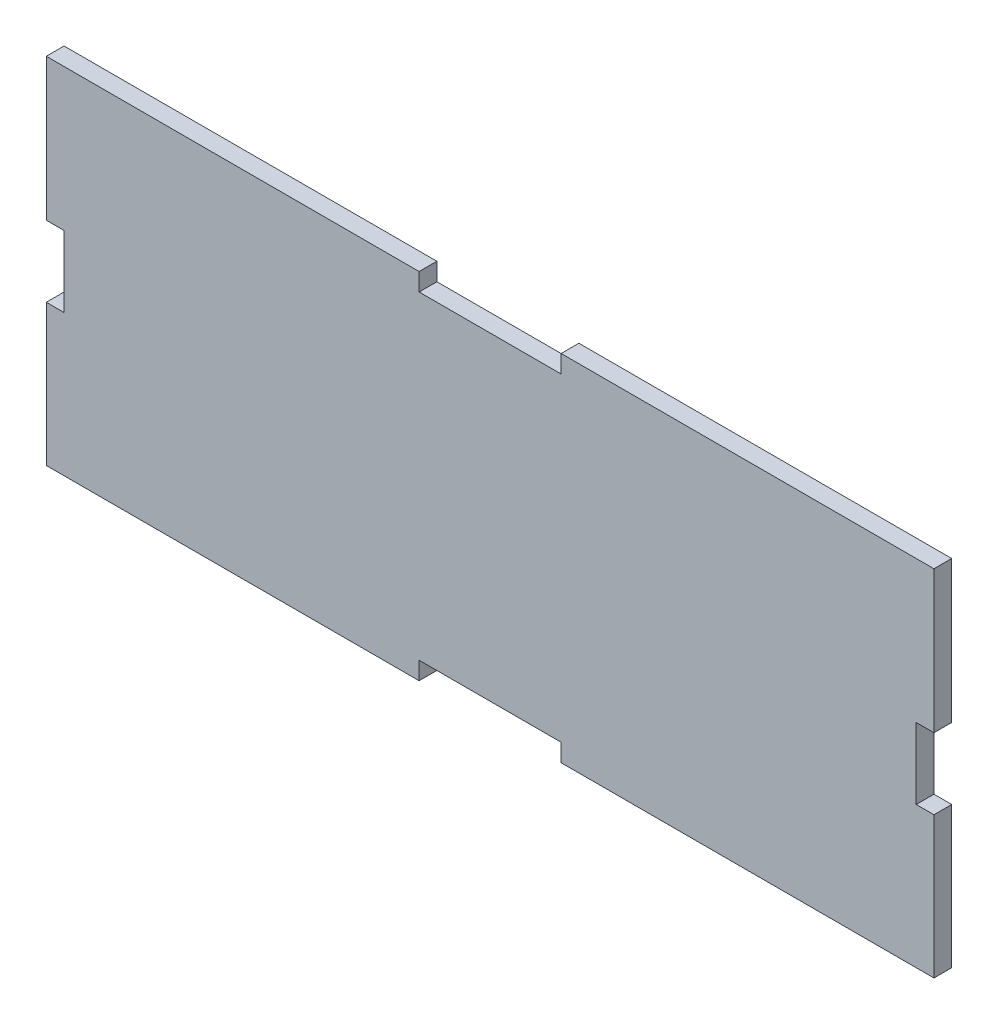
ISO-10303-21;
HEADER;
FILE_DESCRIPTION(('STEP AP214'),'2;1');
FILE_NAME('part.step','',(''),(''),'','','');
FILE_SCHEMA(('AUTOMOTIVE_DESIGN { 1 0 10303 214 1 1 1 1 }'));
ENDSEC;
DATA;
#1=APPLICATION_CONTEXT('core data for automotive mechanical design processes');
#2=APPLICATION_PROTOCOL_DEFINITION('international standard','automotive_design',2000,#1);
#3=PRODUCT_CONTEXT('',#1,'mechanical');
#4=PRODUCT('Part','Part','',(#3));
#5=PRODUCT_RELATED_PRODUCT_CATEGORY('part','',(#4));
#6=PRODUCT_DEFINITION_FORMATION('','',#4);
#7=PRODUCT_DEFINITION_CONTEXT('part definition',#1,'design');
#8=PRODUCT_DEFINITION('design','',#6,#7);
#9=PRODUCT_DEFINITION_SHAPE('','',#8);
#10=(LENGTH_UNIT() NAMED_UNIT(*) SI_UNIT(.MILLI.,.METRE.));
#11=(NAMED_UNIT(*) PLANE_ANGLE_UNIT() SI_UNIT($,.RADIAN.));
#12=(NAMED_UNIT(*) SI_UNIT($,.STERADIAN.) SOLID_ANGLE_UNIT());
#13=UNCERTAINTY_MEASURE_WITH_UNIT(LENGTH_MEASURE(1.E-05),#10,'distance_accuracy_value','');
#14=(GEOMETRIC_REPRESENTATION_CONTEXT(3) GLOBAL_UNCERTAINTY_ASSIGNED_CONTEXT((#13)) GLOBAL_UNIT_ASSIGNED_CONTEXT((#10,
#11,#12)) REPRESENTATION_CONTEXT('',''));
#15=CARTESIAN_POINT('',(0.,0.,0.));
#16=DIRECTION('',(0.,0.,1.));
#17=DIRECTION('',(1.,0.,0.));
#18=AXIS2_PLACEMENT_3D('',#15,#16,#17);
#19=CARTESIAN_POINT('',(0.,17.4393391803182,5.));
#20=DIRECTION('',(1.,0.,0.));
#21=DIRECTION('',(0.,0.,-1.));
#22=AXIS2_PLACEMENT_3D('',#19,#20,#21);
#23=PLANE('',#22);
#24=DIRECTION('',(0.,-1.,0.));
#25=VECTOR('',#24,1.);
#26=CARTESIAN_POINT('',(0.,17.4393391803182,0.));
#27=LINE('',#26,#25);
#28=CARTESIAN_POINT('',(0.,17.4393391803182,0.));
#29=VERTEX_POINT('',#28);
#30=CARTESIAN_POINT('',(0.,-22.5606608196819,0.));
#31=VERTEX_POINT('',#30);
#32=EDGE_CURVE('E200',#29,#31,#27,.T.);
#33=ORIENTED_EDGE('',*,*,#32,.T.);
#34=DIRECTION('',(0.,0.,-1.));
#35=VECTOR('',#34,1.);
#36=CARTESIAN_POINT('',(0.,-22.5606608196819,5.));
#37=LINE('',#36,#35);
#38=CARTESIAN_POINT('',(0.,-22.5606608196819,5.));
#39=VERTEX_POINT('',#38);
#40=EDGE_CURVE('E11',#39,#31,#37,.T.);
#41=ORIENTED_EDGE('',*,*,#40,.F.);
#42=DIRECTION('',(0.,-1.,0.));
#43=VECTOR('',#42,1.);
#44=CARTESIAN_POINT('',(0.,17.4393391803182,5.));
#45=LINE('',#44,#43);
#46=CARTESIAN_POINT('',(0.,17.4393391803182,5.));
#47=VERTEX_POINT('',#46);
#48=EDGE_CURVE('E238',#47,#39,#45,.T.);
#49=ORIENTED_EDGE('',*,*,#48,.F.);
#50=DIRECTION('',(0.,0.,-1.));
#51=VECTOR('',#50,1.);
#52=CARTESIAN_POINT('',(0.,17.4393391803182,5.));
#53=LINE('',#52,#51);
#54=EDGE_CURVE('E196',#47,#29,#53,.T.);
#55=ORIENTED_EDGE('',*,*,#54,.T.);
#56=EDGE_LOOP('',(#33,#41,#49,#55));
#57=FACE_BOUND('',#56,.T.);
#58=ADVANCED_FACE('F32',(#57),#23,.F.);
#59=CARTESIAN_POINT('',(5.,-22.5606608196819,5.));
#60=DIRECTION('',(0.,1.,0.));
#61=DIRECTION('',(0.,0.,1.));
#62=AXIS2_PLACEMENT_3D('',#59,#60,#61);
#63=PLANE('',#62);
#64=DIRECTION('',(1.,0.,0.));
#65=VECTOR('',#64,1.);
#66=CARTESIAN_POINT('',(5.,-22.5606608196819,0.));
#67=LINE('',#66,#65);
#68=CARTESIAN_POINT('',(5.,-22.5606608196819,0.));
#69=VERTEX_POINT('',#68);
#70=EDGE_CURVE('E203',#31,#69,#67,.T.);
#71=ORIENTED_EDGE('',*,*,#70,.T.);
#72=DIRECTION('',(0.,0.,-1.));
#73=VECTOR('',#72,1.);
#74=CARTESIAN_POINT('',(5.,-22.5606608196819,5.));
#75=LINE('',#74,#73);
#76=CARTESIAN_POINT('',(5.,-22.5606608196819,5.));
#77=VERTEX_POINT('',#76);
#78=EDGE_CURVE('E40',#77,#69,#75,.T.);
#79=ORIENTED_EDGE('',*,*,#78,.F.);
#80=DIRECTION('',(1.,0.,0.));
#81=VECTOR('',#80,1.);
#82=CARTESIAN_POINT('',(5.,-22.5606608196819,5.));
#83=LINE('',#82,#81);
#84=EDGE_CURVE('E127',#39,#77,#83,.T.);
#85=ORIENTED_EDGE('',*,*,#84,.F.);
#86=ORIENTED_EDGE('',*,*,#40,.T.);
#87=EDGE_LOOP('',(#71,#79,#85,#86));
#88=FACE_BOUND('',#87,.T.);
#89=ADVANCED_FACE('F356',(#88),#63,.F.);
#90=CARTESIAN_POINT('',(5.,-22.5606608196819,5.));
#91=DIRECTION('',(1.,0.,0.));
#92=DIRECTION('',(0.,0.,-1.));
#93=AXIS2_PLACEMENT_3D('',#90,#91,#92);
#94=PLANE('',#93);
#95=DIRECTION('',(0.,-1.,0.));
#96=VECTOR('',#95,1.);
#97=CARTESIAN_POINT('',(5.,-22.5606608196819,0.));
#98=LINE('',#97,#96);
#99=CARTESIAN_POINT('',(5.,-42.5606608196818,0.));
#100=VERTEX_POINT('',#99);
#101=EDGE_CURVE('E205',#69,#100,#98,.T.);
#102=ORIENTED_EDGE('',*,*,#101,.T.);
#103=DIRECTION('',(0.,0.,-1.));
#104=VECTOR('',#103,1.);
#105=CARTESIAN_POINT('',(5.,-42.5606608196818,5.));
#106=LINE('',#105,#104);
#107=CARTESIAN_POINT('',(5.,-42.5606608196818,5.));
#108=VERTEX_POINT('',#107);
#109=EDGE_CURVE('E281',#108,#100,#106,.T.);
#110=ORIENTED_EDGE('',*,*,#109,.F.);
#111=DIRECTION('',(0.,-1.,0.));
#112=VECTOR('',#111,1.);
#113=CARTESIAN_POINT('',(5.,-22.5606608196819,5.));
#114=LINE('',#113,#112);
#115=EDGE_CURVE('E289',#77,#108,#114,.T.);
#116=ORIENTED_EDGE('',*,*,#115,.F.);
#117=ORIENTED_EDGE('',*,*,#78,.T.);
#118=EDGE_LOOP('',(#102,#110,#116,#117));
#119=FACE_BOUND('',#118,.T.);
#120=ADVANCED_FACE('F287',(#119),#94,.F.);
#121=CARTESIAN_POINT('',(0.,-42.5606608196818,5.));
#122=DIRECTION('',(0.,-1.,0.));
#123=DIRECTION('',(0.,0.,-1.));
#124=AXIS2_PLACEMENT_3D('',#121,#122,#123);
#125=PLANE('',#124);
#126=DIRECTION('',(-1.,0.,0.));
#127=VECTOR('',#126,1.);
#128=CARTESIAN_POINT('',(0.,-42.5606608196818,0.));
#129=LINE('',#128,#127);
#130=CARTESIAN_POINT('',(0.,-42.5606608196818,0.));
#131=VERTEX_POINT('',#130);
#132=EDGE_CURVE('E207',#100,#131,#129,.T.);
#133=ORIENTED_EDGE('',*,*,#132,.T.);
#134=DIRECTION('',(0.,0.,-1.));
#135=VECTOR('',#134,1.);
#136=CARTESIAN_POINT('',(0.,-42.5606608196818,5.));
#137=LINE('',#136,#135);
#138=CARTESIAN_POINT('',(0.,-42.5606608196818,5.));
#139=VERTEX_POINT('',#138);
#140=EDGE_CURVE('E278',#139,#131,#137,.T.);
#141=ORIENTED_EDGE('',*,*,#140,.F.);
#142=DIRECTION('',(-1.,0.,0.));
#143=VECTOR('',#142,1.);
#144=CARTESIAN_POINT('',(0.,-42.5606608196818,5.));
#145=LINE('',#144,#143);
#146=EDGE_CURVE('E307',#108,#139,#145,.T.);
#147=ORIENTED_EDGE('',*,*,#146,.F.);
#148=ORIENTED_EDGE('',*,*,#109,.T.);
#149=EDGE_LOOP('',(#133,#141,#147,#148));
#150=FACE_BOUND('',#149,.T.);
#151=ADVANCED_FACE('F298',(#150),#125,.F.);
#152=CARTESIAN_POINT('',(0.,-42.5606608196818,5.));
#153=DIRECTION('',(1.,0.,0.));
#154=DIRECTION('',(0.,0.,-1.));
#155=AXIS2_PLACEMENT_3D('',#152,#153,#154);
#156=PLANE('',#155);
#157=DIRECTION('',(0.,-1.,0.));
#158=VECTOR('',#157,1.);
#159=CARTESIAN_POINT('',(0.,-42.5606608196818,0.));
#160=LINE('',#159,#158);
#161=CARTESIAN_POINT('',(0.,-82.3798627002289,0.));
#162=VERTEX_POINT('',#161);
#163=EDGE_CURVE('E209',#131,#162,#160,.T.);
#164=ORIENTED_EDGE('',*,*,#163,.T.);
#165=DIRECTION('',(0.,0.,-1.));
#166=VECTOR('',#165,1.);
#167=CARTESIAN_POINT('',(0.,-82.3798627002289,5.));
#168=LINE('',#167,#166);
#169=CARTESIAN_POINT('',(0.,-82.3798627002289,5.));
#170=VERTEX_POINT('',#169);
#171=EDGE_CURVE('E275',#170,#162,#168,.T.);
#172=ORIENTED_EDGE('',*,*,#171,.F.);
#173=DIRECTION('',(0.,-1.,0.));
#174=VECTOR('',#173,1.);
#175=CARTESIAN_POINT('',(0.,-42.5606608196818,5.));
#176=LINE('',#175,#174);
#177=EDGE_CURVE('E304',#139,#170,#176,.T.);
#178=ORIENTED_EDGE('',*,*,#177,.F.);
#179=ORIENTED_EDGE('',*,*,#140,.T.);
#180=EDGE_LOOP('',(#164,#172,#178,#179));
#181=FACE_BOUND('',#180,.T.);
#182=ADVANCED_FACE('F302',(#181),#156,.F.);
#183=CARTESIAN_POINT('',(0.,-82.3798627002289,5.));
#184=DIRECTION('',(0.,1.,0.));
#185=DIRECTION('',(0.,0.,1.));
#186=AXIS2_PLACEMENT_3D('',#183,#184,#185);
#187=PLANE('',#186);
#188=DIRECTION('',(1.,0.,0.));
#189=VECTOR('',#188,1.);
#190=CARTESIAN_POINT('',(0.,-82.3798627002289,0.));
#191=LINE('',#190,#189);
#192=CARTESIAN_POINT('',(105.,-82.3798627002289,0.));
#193=VERTEX_POINT('',#192);
#194=EDGE_CURVE('E211',#162,#193,#191,.T.);
#195=ORIENTED_EDGE('',*,*,#194,.T.);
#196=DIRECTION('',(0.,0.,-1.));
#197=VECTOR('',#196,1.);
#198=CARTESIAN_POINT('',(105.,-82.3798627002289,5.));
#199=LINE('',#198,#197);
#200=CARTESIAN_POINT('',(105.,-82.3798627002289,5.));
#201=VERTEX_POINT('',#200);
#202=EDGE_CURVE('E272',#201,#193,#199,.T.);
#203=ORIENTED_EDGE('',*,*,#202,.F.);
#204=DIRECTION('',(1.,0.,0.));
#205=VECTOR('',#204,1.);
#206=CARTESIAN_POINT('',(0.,-82.3798627002289,5.));
#207=LINE('',#206,#205);
#208=EDGE_CURVE('E306',#170,#201,#207,.T.);
#209=ORIENTED_EDGE('',*,*,#208,.F.);
#210=ORIENTED_EDGE('',*,*,#171,.T.);
#211=EDGE_LOOP('',(#195,#203,#209,#210));
#212=FACE_BOUND('',#211,.T.);
#213=ADVANCED_FACE('F369',(#212),#187,.F.);
#214=CARTESIAN_POINT('',(105.,-77.3798627002289,5.));
#215=DIRECTION('',(-1.,0.,0.));
#216=DIRECTION('',(0.,-1.,0.));
#217=AXIS2_PLACEMENT_3D('',#214,#215,#216);
#218=PLANE('',#217);
#219=DIRECTION('',(0.,1.,0.));
#220=VECTOR('',#219,1.);
#221=CARTESIAN_POINT('',(105.,-77.3798627002289,0.));
#222=LINE('',#221,#220);
#223=CARTESIAN_POINT('',(105.,-77.3798627002289,0.));
#224=VERTEX_POINT('',#223);
#225=EDGE_CURVE('E213',#193,#224,#222,.T.);
#226=ORIENTED_EDGE('',*,*,#225,.T.);
#227=DIRECTION('',(0.,0.,-1.));
#228=VECTOR('',#227,1.);
#229=CARTESIAN_POINT('',(105.,-77.3798627002289,5.));
#230=LINE('',#229,#228);
#231=CARTESIAN_POINT('',(105.,-77.3798627002289,5.));
#232=VERTEX_POINT('',#231);
#233=EDGE_CURVE('E269',#232,#224,#230,.T.);
#234=ORIENTED_EDGE('',*,*,#233,.F.);
#235=DIRECTION('',(0.,1.,0.));
#236=VECTOR('',#235,1.);
#237=CARTESIAN_POINT('',(105.,-77.3798627002289,5.));
#238=LINE('',#237,#236);
#239=EDGE_CURVE('E309',#201,#232,#238,.T.);
#240=ORIENTED_EDGE('',*,*,#239,.F.);
#241=ORIENTED_EDGE('',*,*,#202,.T.);
#242=EDGE_LOOP('',(#226,#234,#240,#241));
#243=FACE_BOUND('',#242,.T.);
#244=ADVANCED_FACE('F372',(#243),#218,.F.);
#245=CARTESIAN_POINT('',(105.,-77.3798627002289,5.));
#246=DIRECTION('',(0.,1.,0.));
#247=DIRECTION('',(0.,0.,1.));
#248=AXIS2_PLACEMENT_3D('',#245,#246,#247);
#249=PLANE('',#248);
#250=DIRECTION('',(1.,0.,0.));
#251=VECTOR('',#250,1.);
#252=CARTESIAN_POINT('',(105.,-77.3798627002289,0.));
#253=LINE('',#252,#251);
#254=CARTESIAN_POINT('',(145.,-77.3798627002289,0.));
#255=VERTEX_POINT('',#254);
#256=EDGE_CURVE('E215',#224,#255,#253,.T.);
#257=ORIENTED_EDGE('',*,*,#256,.T.);
#258=DIRECTION('',(0.,0.,-1.));
#259=VECTOR('',#258,1.);
#260=CARTESIAN_POINT('',(145.,-77.3798627002289,5.));
#261=LINE('',#260,#259);
#262=CARTESIAN_POINT('',(145.,-77.3798627002289,5.));
#263=VERTEX_POINT('',#262);
#264=EDGE_CURVE('E266',#263,#255,#261,.T.);
#265=ORIENTED_EDGE('',*,*,#264,.F.);
#266=DIRECTION('',(1.,0.,0.));
#267=VECTOR('',#266,1.);
#268=CARTESIAN_POINT('',(105.,-77.3798627002289,5.));
#269=LINE('',#268,#267);
#270=EDGE_CURVE('E315',#232,#263,#269,.T.);
#271=ORIENTED_EDGE('',*,*,#270,.F.);
#272=ORIENTED_EDGE('',*,*,#233,.T.);
#273=EDGE_LOOP('',(#257,#265,#271,#272));
#274=FACE_BOUND('',#273,.T.);
#275=ADVANCED_FACE('F376',(#274),#249,.F.);
#276=CARTESIAN_POINT('',(145.,-77.3798627002289,5.));
#277=DIRECTION('',(1.,0.,0.));
#278=DIRECTION('',(0.,0.,-1.));
#279=AXIS2_PLACEMENT_3D('',#276,#277,#278);
#280=PLANE('',#279);
#281=DIRECTION('',(0.,-1.,0.));
#282=VECTOR('',#281,1.);
#283=CARTESIAN_POINT('',(145.,-77.3798627002289,0.));
#284=LINE('',#283,#282);
#285=CARTESIAN_POINT('',(145.,-82.3798627002289,0.));
#286=VERTEX_POINT('',#285);
#287=EDGE_CURVE('E217',#255,#286,#284,.T.);
#288=ORIENTED_EDGE('',*,*,#287,.T.);
#289=DIRECTION('',(0.,0.,-1.));
#290=VECTOR('',#289,1.);
#291=CARTESIAN_POINT('',(145.,-82.3798627002289,5.));
#292=LINE('',#291,#290);
#293=CARTESIAN_POINT('',(145.,-82.3798627002289,5.));
#294=VERTEX_POINT('',#293);
#295=EDGE_CURVE('E263',#294,#286,#292,.T.);
#296=ORIENTED_EDGE('',*,*,#295,.F.);
#297=DIRECTION('',(0.,-1.,0.));
#298=VECTOR('',#297,1.);
#299=CARTESIAN_POINT('',(145.,-77.3798627002289,5.));
#300=LINE('',#299,#298);
#301=EDGE_CURVE('E317',#263,#294,#300,.T.);
#302=ORIENTED_EDGE('',*,*,#301,.F.);
#303=ORIENTED_EDGE('',*,*,#264,.T.);
#304=EDGE_LOOP('',(#288,#296,#302,#303));
#305=FACE_BOUND('',#304,.T.);
#306=ADVANCED_FACE('F380',(#305),#280,.F.);
#307=CARTESIAN_POINT('',(145.,-82.3798627002289,5.));
#308=DIRECTION('',(0.,1.,0.));
#309=DIRECTION('',(0.,0.,1.));
#310=AXIS2_PLACEMENT_3D('',#307,#308,#309);
#311=PLANE('',#310);
#312=DIRECTION('',(1.,0.,0.));
#313=VECTOR('',#312,1.);
#314=CARTESIAN_POINT('',(145.,-82.3798627002289,0.));
#315=LINE('',#314,#313);
#316=CARTESIAN_POINT('',(250.,-82.3798627002289,0.));
#317=VERTEX_POINT('',#316);
#318=EDGE_CURVE('E219',#286,#317,#315,.T.);
#319=ORIENTED_EDGE('',*,*,#318,.T.);
#320=DIRECTION('',(0.,0.,-1.));
#321=VECTOR('',#320,1.);
#322=CARTESIAN_POINT('',(250.,-82.3798627002289,5.));
#323=LINE('',#322,#321);
#324=CARTESIAN_POINT('',(250.,-82.3798627002289,5.));
#325=VERTEX_POINT('',#324);
#326=EDGE_CURVE('E260',#325,#317,#323,.T.);
#327=ORIENTED_EDGE('',*,*,#326,.F.);
#328=DIRECTION('',(1.,0.,0.));
#329=VECTOR('',#328,1.);
#330=CARTESIAN_POINT('',(145.,-82.3798627002289,5.));
#331=LINE('',#330,#329);
#332=EDGE_CURVE('E319',#294,#325,#331,.T.);
#333=ORIENTED_EDGE('',*,*,#332,.F.);
#334=ORIENTED_EDGE('',*,*,#295,.T.);
#335=EDGE_LOOP('',(#319,#327,#333,#334));
#336=FACE_BOUND('',#335,.T.);
#337=ADVANCED_FACE('F384',(#336),#311,.F.);
#338=CARTESIAN_POINT('',(250.,-42.5606608196818,5.));
#339=DIRECTION('',(-1.,0.,0.));
#340=DIRECTION('',(0.,0.,1.));
#341=AXIS2_PLACEMENT_3D('',#338,#339,#340);
#342=PLANE('',#341);
#343=DIRECTION('',(0.,1.,0.));
#344=VECTOR('',#343,1.);
#345=CARTESIAN_POINT('',(250.,-42.5606608196818,0.));
#346=LINE('',#345,#344);
#347=CARTESIAN_POINT('',(250.,-42.5606608196818,0.));
#348=VERTEX_POINT('',#347);
#349=EDGE_CURVE('E221',#317,#348,#346,.T.);
#350=ORIENTED_EDGE('',*,*,#349,.T.);
#351=DIRECTION('',(0.,0.,-1.));
#352=VECTOR('',#351,1.);
#353=CARTESIAN_POINT('',(250.,-42.5606608196818,5.));
#354=LINE('',#353,#352);
#355=CARTESIAN_POINT('',(250.,-42.5606608196818,5.));
#356=VERTEX_POINT('',#355);
#357=EDGE_CURVE('E257',#356,#348,#354,.T.);
#358=ORIENTED_EDGE('',*,*,#357,.F.);
#359=DIRECTION('',(0.,1.,0.));
#360=VECTOR('',#359,1.);
#361=CARTESIAN_POINT('',(250.,-42.5606608196818,5.));
#362=LINE('',#361,#360);
#363=EDGE_CURVE('E321',#325,#356,#362,.T.);
#364=ORIENTED_EDGE('',*,*,#363,.F.);
#365=ORIENTED_EDGE('',*,*,#326,.T.);
#366=EDGE_LOOP('',(#350,#358,#364,#365));
#367=FACE_BOUND('',#366,.T.);
#368=ADVANCED_FACE('F388',(#367),#342,.F.);
#369=CARTESIAN_POINT('',(245.,-42.5606608196817,5.));
#370=DIRECTION('',(0.,-1.,0.));
#371=DIRECTION('',(1.,0.,0.));
#372=AXIS2_PLACEMENT_3D('',#369,#370,#371);
#373=PLANE('',#372);
#374=DIRECTION('',(-1.,0.,0.));
#375=VECTOR('',#374,1.);
#376=CARTESIAN_POINT('',(245.,-42.5606608196817,0.));
#377=LINE('',#376,#375);
#378=CARTESIAN_POINT('',(245.,-42.5606608196817,0.));
#379=VERTEX_POINT('',#378);
#380=EDGE_CURVE('E223',#348,#379,#377,.T.);
#381=ORIENTED_EDGE('',*,*,#380,.T.);
#382=DIRECTION('',(0.,0.,-1.));
#383=VECTOR('',#382,1.);
#384=CARTESIAN_POINT('',(245.,-42.5606608196817,5.));
#385=LINE('',#384,#383);
#386=CARTESIAN_POINT('',(245.,-42.5606608196817,5.));
#387=VERTEX_POINT('',#386);
#388=EDGE_CURVE('E254',#387,#379,#385,.T.);
#389=ORIENTED_EDGE('',*,*,#388,.F.);
#390=DIRECTION('',(-1.,0.,0.));
#391=VECTOR('',#390,1.);
#392=CARTESIAN_POINT('',(245.,-42.5606608196817,5.));
#393=LINE('',#392,#391);
#394=EDGE_CURVE('E323',#356,#387,#393,.T.);
#395=ORIENTED_EDGE('',*,*,#394,.F.);
#396=ORIENTED_EDGE('',*,*,#357,.T.);
#397=EDGE_LOOP('',(#381,#389,#395,#396));
#398=FACE_BOUND('',#397,.T.);
#399=ADVANCED_FACE('F392',(#398),#373,.F.);
#400=CARTESIAN_POINT('',(245.,-42.5606608196817,5.));
#401=DIRECTION('',(-1.,0.,0.));
#402=DIRECTION('',(0.,-1.,0.));
#403=AXIS2_PLACEMENT_3D('',#400,#401,#402);
#404=PLANE('',#403);
#405=DIRECTION('',(0.,1.,0.));
#406=VECTOR('',#405,1.);
#407=CARTESIAN_POINT('',(245.,-42.5606608196817,0.));
#408=LINE('',#407,#406);
#409=CARTESIAN_POINT('',(245.,-22.5606608196818,0.));
#410=VERTEX_POINT('',#409);
#411=EDGE_CURVE('E225',#379,#410,#408,.T.);
#412=ORIENTED_EDGE('',*,*,#411,.T.);
#413=DIRECTION('',(0.,0.,-1.));
#414=VECTOR('',#413,1.);
#415=CARTESIAN_POINT('',(245.,-22.5606608196818,5.));
#416=LINE('',#415,#414);
#417=CARTESIAN_POINT('',(245.,-22.5606608196818,5.));
#418=VERTEX_POINT('',#417);
#419=EDGE_CURVE('E251',#418,#410,#416,.T.);
#420=ORIENTED_EDGE('',*,*,#419,.F.);
#421=DIRECTION('',(0.,1.,0.));
#422=VECTOR('',#421,1.);
#423=CARTESIAN_POINT('',(245.,-42.5606608196817,5.));
#424=LINE('',#423,#422);
#425=EDGE_CURVE('E325',#387,#418,#424,.T.);
#426=ORIENTED_EDGE('',*,*,#425,.F.);
#427=ORIENTED_EDGE('',*,*,#388,.T.);
#428=EDGE_LOOP('',(#412,#420,#426,#427));
#429=FACE_BOUND('',#428,.T.);
#430=ADVANCED_FACE('F396',(#429),#404,.F.);
#431=CARTESIAN_POINT('',(250.,-22.5606608196818,5.));
#432=DIRECTION('',(0.,1.,0.));
#433=DIRECTION('',(0.,0.,1.));
#434=AXIS2_PLACEMENT_3D('',#431,#432,#433);
#435=PLANE('',#434);
#436=DIRECTION('',(1.,0.,0.));
#437=VECTOR('',#436,1.);
#438=CARTESIAN_POINT('',(250.,-22.5606608196818,0.));
#439=LINE('',#438,#437);
#440=CARTESIAN_POINT('',(250.,-22.5606608196818,0.));
#441=VERTEX_POINT('',#440);
#442=EDGE_CURVE('E227',#410,#441,#439,.T.);
#443=ORIENTED_EDGE('',*,*,#442,.T.);
#444=DIRECTION('',(0.,0.,-1.));
#445=VECTOR('',#444,1.);
#446=CARTESIAN_POINT('',(250.,-22.5606608196818,5.));
#447=LINE('',#446,#445);
#448=CARTESIAN_POINT('',(250.,-22.5606608196818,5.));
#449=VERTEX_POINT('',#448);
#450=EDGE_CURVE('E248',#449,#441,#447,.T.);
#451=ORIENTED_EDGE('',*,*,#450,.F.);
#452=DIRECTION('',(1.,0.,0.));
#453=VECTOR('',#452,1.);
#454=CARTESIAN_POINT('',(250.,-22.5606608196818,5.));
#455=LINE('',#454,#453);
#456=EDGE_CURVE('E327',#418,#449,#455,.T.);
#457=ORIENTED_EDGE('',*,*,#456,.F.);
#458=ORIENTED_EDGE('',*,*,#419,.T.);
#459=EDGE_LOOP('',(#443,#451,#457,#458));
#460=FACE_BOUND('',#459,.T.);
#461=ADVANCED_FACE('F400',(#460),#435,.F.);
#462=CARTESIAN_POINT('',(250.,17.4393391803182,5.));
#463=DIRECTION('',(-1.,0.,0.));
#464=DIRECTION('',(0.,0.,1.));
#465=AXIS2_PLACEMENT_3D('',#462,#463,#464);
#466=PLANE('',#465);
#467=DIRECTION('',(0.,1.,0.));
#468=VECTOR('',#467,1.);
#469=CARTESIAN_POINT('',(250.,17.4393391803182,0.));
#470=LINE('',#469,#468);
#471=CARTESIAN_POINT('',(250.,17.4393391803182,0.));
#472=VERTEX_POINT('',#471);
#473=EDGE_CURVE('E229',#441,#472,#470,.T.);
#474=ORIENTED_EDGE('',*,*,#473,.T.);
#475=DIRECTION('',(0.,0.,-1.));
#476=VECTOR('',#475,1.);
#477=CARTESIAN_POINT('',(250.,17.4393391803182,5.));
#478=LINE('',#477,#476);
#479=CARTESIAN_POINT('',(250.,17.4393391803182,5.));
#480=VERTEX_POINT('',#479);
#481=EDGE_CURVE('E245',#480,#472,#478,.T.);
#482=ORIENTED_EDGE('',*,*,#481,.F.);
#483=DIRECTION('',(0.,1.,0.));
#484=VECTOR('',#483,1.);
#485=CARTESIAN_POINT('',(250.,17.4393391803182,5.));
#486=LINE('',#485,#484);
#487=EDGE_CURVE('E329',#449,#480,#486,.T.);
#488=ORIENTED_EDGE('',*,*,#487,.F.);
#489=ORIENTED_EDGE('',*,*,#450,.T.);
#490=EDGE_LOOP('',(#474,#482,#488,#489));
#491=FACE_BOUND('',#490,.T.);
#492=ADVANCED_FACE('F404',(#491),#466,.F.);
#493=CARTESIAN_POINT('',(145.,17.4393391803182,5.));
#494=DIRECTION('',(0.,-1.,0.));
#495=DIRECTION('',(0.,0.,-1.));
#496=AXIS2_PLACEMENT_3D('',#493,#494,#495);
#497=PLANE('',#496);
#498=DIRECTION('',(-1.,0.,0.));
#499=VECTOR('',#498,1.);
#500=CARTESIAN_POINT('',(145.,17.4393391803182,0.));
#501=LINE('',#500,#499);
#502=CARTESIAN_POINT('',(145.,17.4393391803182,0.));
#503=VERTEX_POINT('',#502);
#504=EDGE_CURVE('E231',#472,#503,#501,.T.);
#505=ORIENTED_EDGE('',*,*,#504,.T.);
#506=DIRECTION('',(0.,0.,-1.));
#507=VECTOR('',#506,1.);
#508=CARTESIAN_POINT('',(145.,17.4393391803182,5.));
#509=LINE('',#508,#507);
#510=CARTESIAN_POINT('',(145.,17.4393391803182,5.));
#511=VERTEX_POINT('',#510);
#512=EDGE_CURVE('E242',#511,#503,#509,.T.);
#513=ORIENTED_EDGE('',*,*,#512,.F.);
#514=DIRECTION('',(-1.,0.,0.));
#515=VECTOR('',#514,1.);
#516=CARTESIAN_POINT('',(145.,17.4393391803182,5.));
#517=LINE('',#516,#515);
#518=EDGE_CURVE('E331',#480,#511,#517,.T.);
#519=ORIENTED_EDGE('',*,*,#518,.F.);
#520=ORIENTED_EDGE('',*,*,#481,.T.);
#521=EDGE_LOOP('',(#505,#513,#519,#520));
#522=FACE_BOUND('',#521,.T.);
#523=ADVANCED_FACE('F337',(#522),#497,.F.);
#524=CARTESIAN_POINT('',(145.,12.4393391803182,5.));
#525=DIRECTION('',(1.,0.,0.));
#526=DIRECTION('',(0.,0.,-1.));
#527=AXIS2_PLACEMENT_3D('',#524,#525,#526);
#528=PLANE('',#527);
#529=DIRECTION('',(0.,-1.,0.));
#530=VECTOR('',#529,1.);
#531=CARTESIAN_POINT('',(145.,12.4393391803182,0.));
#532=LINE('',#531,#530);
#533=CARTESIAN_POINT('',(145.,12.4393391803182,0.));
#534=VERTEX_POINT('',#533);
#535=EDGE_CURVE('E233',#503,#534,#532,.T.);
#536=ORIENTED_EDGE('',*,*,#535,.T.);
#537=DIRECTION('',(0.,0.,-1.));
#538=VECTOR('',#537,1.);
#539=CARTESIAN_POINT('',(145.,12.4393391803182,5.));
#540=LINE('',#539,#538);
#541=CARTESIAN_POINT('',(145.,12.4393391803182,5.));
#542=VERTEX_POINT('',#541);
#543=EDGE_CURVE('E191',#542,#534,#540,.T.);
#544=ORIENTED_EDGE('',*,*,#543,.F.);
#545=DIRECTION('',(0.,-1.,0.));
#546=VECTOR('',#545,1.);
#547=CARTESIAN_POINT('',(145.,12.4393391803182,5.));
#548=LINE('',#547,#546);
#549=EDGE_CURVE('E182',#511,#542,#548,.T.);
#550=ORIENTED_EDGE('',*,*,#549,.F.);
#551=ORIENTED_EDGE('',*,*,#512,.T.);
#552=EDGE_LOOP('',(#536,#544,#550,#551));
#553=FACE_BOUND('',#552,.T.);
#554=ADVANCED_FACE('F341',(#553),#528,.F.);
#555=CARTESIAN_POINT('',(105.,12.4393391803182,5.));
#556=DIRECTION('',(0.,-1.,0.));
#557=DIRECTION('',(1.,0.,0.));
#558=AXIS2_PLACEMENT_3D('',#555,#556,#557);
#559=PLANE('',#558);
#560=DIRECTION('',(-1.,0.,0.));
#561=VECTOR('',#560,1.);
#562=CARTESIAN_POINT('',(105.,12.4393391803182,0.));
#563=LINE('',#562,#561);
#564=CARTESIAN_POINT('',(105.,12.4393391803182,0.));
#565=VERTEX_POINT('',#564);
#566=EDGE_CURVE('E190',#534,#565,#563,.T.);
#567=ORIENTED_EDGE('',*,*,#566,.T.);
#568=DIRECTION('',(0.,0.,-1.));
#569=VECTOR('',#568,1.);
#570=CARTESIAN_POINT('',(105.,12.4393391803182,5.));
#571=LINE('',#570,#569);
#572=CARTESIAN_POINT('',(105.,12.4393391803182,5.));
#573=VERTEX_POINT('',#572);
#574=EDGE_CURVE('E187',#573,#565,#571,.T.);
#575=ORIENTED_EDGE('',*,*,#574,.F.);
#576=DIRECTION('',(-1.,0.,0.));
#577=VECTOR('',#576,1.);
#578=CARTESIAN_POINT('',(105.,12.4393391803182,5.));
#579=LINE('',#578,#577);
#580=EDGE_CURVE('E176',#542,#573,#579,.T.);
#581=ORIENTED_EDGE('',*,*,#580,.F.);
#582=ORIENTED_EDGE('',*,*,#543,.T.);
#583=EDGE_LOOP('',(#567,#575,#581,#582));
#584=FACE_BOUND('',#583,.T.);
#585=ADVANCED_FACE('F188',(#584),#559,.F.);
#586=CARTESIAN_POINT('',(105.,12.4393391803182,5.));
#587=DIRECTION('',(-1.,0.,0.));
#588=DIRECTION('',(0.,0.,1.));
#589=AXIS2_PLACEMENT_3D('',#586,#587,#588);
#590=PLANE('',#589);
#591=DIRECTION('',(0.,1.,0.));
#592=VECTOR('',#591,1.);
#593=CARTESIAN_POINT('',(105.,12.4393391803182,0.));
#594=LINE('',#593,#592);
#595=CARTESIAN_POINT('',(105.,17.4393391803182,0.));
#596=VERTEX_POINT('',#595);
#597=EDGE_CURVE('E113',#565,#596,#594,.T.);
#598=ORIENTED_EDGE('',*,*,#597,.T.);
#599=DIRECTION('',(0.,0.,-1.));
#600=VECTOR('',#599,1.);
#601=CARTESIAN_POINT('',(105.,17.4393391803182,5.));
#602=LINE('',#601,#600);
#603=CARTESIAN_POINT('',(105.,17.4393391803182,5.));
#604=VERTEX_POINT('',#603);
#605=EDGE_CURVE('E192',#604,#596,#602,.T.);
#606=ORIENTED_EDGE('',*,*,#605,.F.);
#607=DIRECTION('',(0.,1.,0.));
#608=VECTOR('',#607,1.);
#609=CARTESIAN_POINT('',(105.,12.4393391803182,5.));
#610=LINE('',#609,#608);
#611=EDGE_CURVE('E180',#573,#604,#610,.T.);
#612=ORIENTED_EDGE('',*,*,#611,.F.);
#613=ORIENTED_EDGE('',*,*,#574,.T.);
#614=EDGE_LOOP('',(#598,#606,#612,#613));
#615=FACE_BOUND('',#614,.T.);
#616=ADVANCED_FACE('F194',(#615),#590,.F.);
#617=CARTESIAN_POINT('',(0.,17.4393391803182,5.));
#618=DIRECTION('',(0.,-1.,0.));
#619=DIRECTION('',(0.,0.,-1.));
#620=AXIS2_PLACEMENT_3D('',#617,#618,#619);
#621=PLANE('',#620);
#622=DIRECTION('',(-1.,0.,0.));
#623=VECTOR('',#622,1.);
#624=CARTESIAN_POINT('',(0.,17.4393391803182,0.));
#625=LINE('',#624,#623);
#626=EDGE_CURVE('E119',#596,#29,#625,.T.);
#627=ORIENTED_EDGE('',*,*,#626,.T.);
#628=ORIENTED_EDGE('',*,*,#54,.F.);
#629=DIRECTION('',(-1.,0.,0.));
#630=VECTOR('',#629,1.);
#631=CARTESIAN_POINT('',(0.,17.4393391803182,5.));
#632=LINE('',#631,#630);
#633=EDGE_CURVE('E48',#604,#47,#632,.T.);
#634=ORIENTED_EDGE('',*,*,#633,.F.);
#635=ORIENTED_EDGE('',*,*,#605,.T.);
#636=EDGE_LOOP('',(#627,#628,#634,#635));
#637=FACE_BOUND('',#636,.T.);
#638=ADVANCED_FACE('F345',(#637),#621,.F.);
#639=CARTESIAN_POINT('',(0.,0.,5.));
#640=DIRECTION('',(0.,0.,-1.));
#641=DIRECTION('',(-1.,0.,0.));
#642=AXIS2_PLACEMENT_3D('',#639,#640,#641);
#643=PLANE('',#642);
#644=ORIENTED_EDGE('',*,*,#48,.T.);
#645=ORIENTED_EDGE('',*,*,#84,.T.);
#646=ORIENTED_EDGE('',*,*,#115,.T.);
#647=ORIENTED_EDGE('',*,*,#146,.T.);
#648=ORIENTED_EDGE('',*,*,#177,.T.);
#649=ORIENTED_EDGE('',*,*,#208,.T.);
#650=ORIENTED_EDGE('',*,*,#239,.T.);
#651=ORIENTED_EDGE('',*,*,#270,.T.);
#652=ORIENTED_EDGE('',*,*,#301,.T.);
#653=ORIENTED_EDGE('',*,*,#332,.T.);
#654=ORIENTED_EDGE('',*,*,#363,.T.);
#655=ORIENTED_EDGE('',*,*,#394,.T.);
#656=ORIENTED_EDGE('',*,*,#425,.T.);
#657=ORIENTED_EDGE('',*,*,#456,.T.);
#658=ORIENTED_EDGE('',*,*,#487,.T.);
#659=ORIENTED_EDGE('',*,*,#518,.T.);
#660=ORIENTED_EDGE('',*,*,#549,.T.);
#661=ORIENTED_EDGE('',*,*,#580,.T.);
#662=ORIENTED_EDGE('',*,*,#611,.T.);
#663=ORIENTED_EDGE('',*,*,#633,.T.);
#664=EDGE_LOOP('',(#644,#645,#646,#647,#648,#649,#650,#651,#652,#653,#654,#655,#656,#657,#658,
#659,#660,#661,#662,#663));
#665=FACE_BOUND('',#664,.T.);
#666=ADVANCED_FACE('F178',(#665),#643,.F.);
#667=CARTESIAN_POINT('',(0.,0.,0.));
#668=DIRECTION('',(0.,0.,-1.));
#669=DIRECTION('',(-1.,0.,0.));
#670=AXIS2_PLACEMENT_3D('',#667,#668,#669);
#671=PLANE('',#670);
#672=ORIENTED_EDGE('',*,*,#32,.F.);
#673=ORIENTED_EDGE('',*,*,#626,.F.);
#674=ORIENTED_EDGE('',*,*,#597,.F.);
#675=ORIENTED_EDGE('',*,*,#566,.F.);
#676=ORIENTED_EDGE('',*,*,#535,.F.);
#677=ORIENTED_EDGE('',*,*,#504,.F.);
#678=ORIENTED_EDGE('',*,*,#473,.F.);
#679=ORIENTED_EDGE('',*,*,#442,.F.);
#680=ORIENTED_EDGE('',*,*,#411,.F.);
#681=ORIENTED_EDGE('',*,*,#380,.F.);
#682=ORIENTED_EDGE('',*,*,#349,.F.);
#683=ORIENTED_EDGE('',*,*,#318,.F.);
#684=ORIENTED_EDGE('',*,*,#287,.F.);
#685=ORIENTED_EDGE('',*,*,#256,.F.);
#686=ORIENTED_EDGE('',*,*,#225,.F.);
#687=ORIENTED_EDGE('',*,*,#194,.F.);
#688=ORIENTED_EDGE('',*,*,#163,.F.);
#689=ORIENTED_EDGE('',*,*,#132,.F.);
#690=ORIENTED_EDGE('',*,*,#101,.F.);
#691=ORIENTED_EDGE('',*,*,#70,.F.);
#692=EDGE_LOOP('',(#672,#673,#674,#675,#676,#677,#678,#679,#680,#681,#682,#683,#684,#685,#686,
#687,#688,#689,#690,#691));
#693=FACE_BOUND('',#692,.T.);
#694=ADVANCED_FACE('F293',(#693),#671,.T.);
#695=CLOSED_SHELL('',(#58,#89,#120,#151,#182,#213,#244,#275,#306,#337,#368,#399,#430,#461,#492,
#523,#554,#585,#616,#638,#666,#694));
#696=MANIFOLD_SOLID_BREP('B2',#695);
#697=ADVANCED_BREP_SHAPE_REPRESENTATION('',(#18,#696),#14);
#698=SHAPE_DEFINITION_REPRESENTATION(#9,#697);
ENDSEC;
END-ISO-10303-21;
